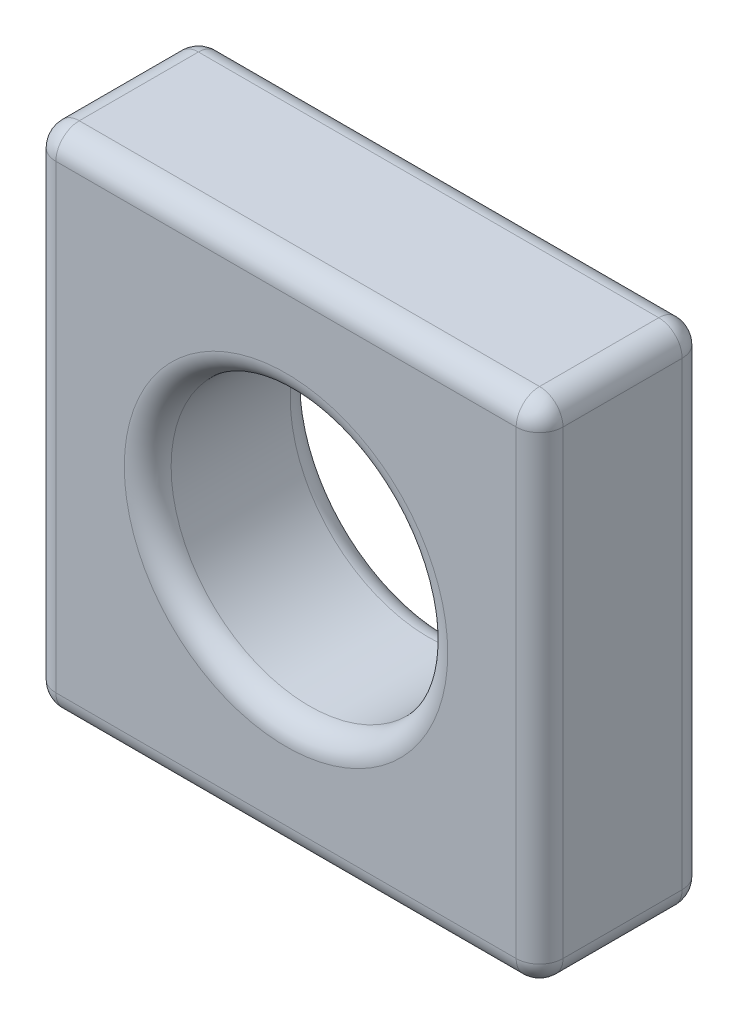
ISO-10303-21;
HEADER;
FILE_DESCRIPTION(('STEP AP214'),'2;1');
FILE_NAME('part.step','',(''),(''),'','','');
FILE_SCHEMA(('AUTOMOTIVE_DESIGN { 1 0 10303 214 1 1 1 1 }'));
ENDSEC;
DATA;
#1=APPLICATION_CONTEXT('core data for automotive mechanical design processes');
#2=APPLICATION_PROTOCOL_DEFINITION('international standard','automotive_design',2000,#1);
#3=PRODUCT_CONTEXT('',#1,'mechanical');
#4=PRODUCT('Part','Part','',(#3));
#5=PRODUCT_RELATED_PRODUCT_CATEGORY('part','',(#4));
#6=PRODUCT_DEFINITION_FORMATION('','',#4);
#7=PRODUCT_DEFINITION_CONTEXT('part definition',#1,'design');
#8=PRODUCT_DEFINITION('design','',#6,#7);
#9=PRODUCT_DEFINITION_SHAPE('','',#8);
#10=(LENGTH_UNIT() NAMED_UNIT(*) SI_UNIT(.MILLI.,.METRE.));
#11=(NAMED_UNIT(*) PLANE_ANGLE_UNIT() SI_UNIT($,.RADIAN.));
#12=(NAMED_UNIT(*) SI_UNIT($,.STERADIAN.) SOLID_ANGLE_UNIT());
#13=UNCERTAINTY_MEASURE_WITH_UNIT(LENGTH_MEASURE(1.E-05),#10,'distance_accuracy_value','');
#14=(GEOMETRIC_REPRESENTATION_CONTEXT(3) GLOBAL_UNCERTAINTY_ASSIGNED_CONTEXT((#13)) GLOBAL_UNIT_ASSIGNED_CONTEXT((#10,
#11,#12)) REPRESENTATION_CONTEXT('',''));
#15=CARTESIAN_POINT('',(0.,0.,0.));
#16=DIRECTION('',(0.,0.,1.));
#17=DIRECTION('',(1.,0.,0.));
#18=AXIS2_PLACEMENT_3D('',#15,#16,#17);
#19=CARTESIAN_POINT('',(0.,0.,1.8));
#20=DIRECTION('',(0.,0.,-1.));
#21=DIRECTION('',(-1.,0.,0.));
#22=AXIS2_PLACEMENT_3D('',#19,#20,#21);
#23=PLANE('',#22);
#24=DIRECTION('',(0.,1.,0.));
#25=VECTOR('',#24,1.);
#26=CARTESIAN_POINT('',(5.246,0.,1.8));
#27=LINE('',#26,#25);
#28=CARTESIAN_POINT('',(5.246,0.254,1.8));
#29=VERTEX_POINT('',#28);
#30=CARTESIAN_POINT('',(5.246,5.246,1.8));
#31=VERTEX_POINT('',#30);
#32=EDGE_CURVE('E157',#29,#31,#27,.T.);
#33=ORIENTED_EDGE('',*,*,#32,.T.);
#34=DIRECTION('',(-1.,0.,0.));
#35=VECTOR('',#34,1.);
#36=CARTESIAN_POINT('',(0.,5.246,1.8));
#37=LINE('',#36,#35);
#38=CARTESIAN_POINT('',(0.254,5.246,1.8));
#39=VERTEX_POINT('',#38);
#40=EDGE_CURVE('E128',#31,#39,#37,.T.);
#41=ORIENTED_EDGE('',*,*,#40,.T.);
#42=DIRECTION('',(0.,-1.,0.));
#43=VECTOR('',#42,1.);
#44=CARTESIAN_POINT('',(0.254,0.,1.8));
#45=LINE('',#44,#43);
#46=CARTESIAN_POINT('',(0.254,0.254,1.8));
#47=VERTEX_POINT('',#46);
#48=EDGE_CURVE('E146',#39,#47,#45,.T.);
#49=ORIENTED_EDGE('',*,*,#48,.T.);
#50=DIRECTION('',(1.,0.,0.));
#51=VECTOR('',#50,1.);
#52=CARTESIAN_POINT('',(0.,0.254,1.8));
#53=LINE('',#52,#51);
#54=EDGE_CURVE('E152',#47,#29,#53,.T.);
#55=ORIENTED_EDGE('',*,*,#54,.T.);
#56=EDGE_LOOP('',(#33,#41,#49,#55));
#57=FACE_BOUND('',#56,.T.);
#58=CARTESIAN_POINT('',(2.75,2.75,1.8));
#59=DIRECTION('',(0.,0.,-1.));
#60=DIRECTION('',(-1.,0.,0.));
#61=AXIS2_PLACEMENT_3D('',#58,#59,#60);
#62=CIRCLE('',#61,1.754);
#63=CARTESIAN_POINT('',(0.995999999999999,2.75,1.8));
#64=VERTEX_POINT('',#63);
#65=EDGE_CURVE('E153',#64,#64,#62,.T.);
#66=ORIENTED_EDGE('',*,*,#65,.T.);
#67=EDGE_LOOP('',(#66));
#68=FACE_BOUND('',#67,.T.);
#69=ADVANCED_FACE('F33',(#57,#68),#23,.F.);
#70=CARTESIAN_POINT('',(0.,0.,0.));
#71=DIRECTION('',(0.,0.,-1.));
#72=DIRECTION('',(-1.,0.,0.));
#73=AXIS2_PLACEMENT_3D('',#70,#71,#72);
#74=PLANE('',#73);
#75=DIRECTION('',(0.,1.,0.));
#76=VECTOR('',#75,1.);
#77=CARTESIAN_POINT('',(5.246,0.,0.));
#78=LINE('',#77,#76);
#79=CARTESIAN_POINT('',(5.246,5.246,0.));
#80=VERTEX_POINT('',#79);
#81=CARTESIAN_POINT('',(5.246,0.254,0.));
#82=VERTEX_POINT('',#81);
#83=EDGE_CURVE('E50',#80,#82,#78,.F.);
#84=ORIENTED_EDGE('',*,*,#83,.T.);
#85=DIRECTION('',(1.,0.,0.));
#86=VECTOR('',#85,1.);
#87=CARTESIAN_POINT('',(0.,0.254,0.));
#88=LINE('',#87,#86);
#89=CARTESIAN_POINT('',(0.254,0.254,0.));
#90=VERTEX_POINT('',#89);
#91=EDGE_CURVE('E204',#82,#90,#88,.F.);
#92=ORIENTED_EDGE('',*,*,#91,.T.);
#93=DIRECTION('',(0.,-1.,0.));
#94=VECTOR('',#93,1.);
#95=CARTESIAN_POINT('',(0.254,5.5,0.));
#96=LINE('',#95,#94);
#97=CARTESIAN_POINT('',(0.254,5.246,0.));
#98=VERTEX_POINT('',#97);
#99=EDGE_CURVE('E200',#90,#98,#96,.F.);
#100=ORIENTED_EDGE('',*,*,#99,.T.);
#101=DIRECTION('',(-1.,0.,0.));
#102=VECTOR('',#101,1.);
#103=CARTESIAN_POINT('',(5.5,5.246,0.));
#104=LINE('',#103,#102);
#105=EDGE_CURVE('E55',#98,#80,#104,.F.);
#106=ORIENTED_EDGE('',*,*,#105,.T.);
#107=EDGE_LOOP('',(#84,#92,#100,#106));
#108=FACE_BOUND('',#107,.T.);
#109=CARTESIAN_POINT('',(2.75,2.75,0.));
#110=DIRECTION('',(0.,0.,-1.));
#111=DIRECTION('',(-1.,0.,0.));
#112=AXIS2_PLACEMENT_3D('',#109,#110,#111);
#113=CIRCLE('',#112,1.754);
#114=CARTESIAN_POINT('',(0.995999999999999,2.75,0.));
#115=VERTEX_POINT('',#114);
#116=EDGE_CURVE('E197',#115,#115,#113,.F.);
#117=ORIENTED_EDGE('',*,*,#116,.T.);
#118=EDGE_LOOP('',(#117));
#119=FACE_BOUND('',#118,.T.);
#120=ADVANCED_FACE('F324',(#108,#119),#74,.T.);
#121=CARTESIAN_POINT('',(0.,0.,1.8));
#122=DIRECTION('',(1.,0.,0.));
#123=DIRECTION('',(0.,0.,-1.));
#124=AXIS2_PLACEMENT_3D('',#121,#122,#123);
#125=PLANE('',#124);
#126=DIRECTION('',(0.,-1.,0.));
#127=VECTOR('',#126,1.);
#128=CARTESIAN_POINT('',(0.,0.,0.254));
#129=LINE('',#128,#127);
#130=CARTESIAN_POINT('',(0.,5.246,0.254));
#131=VERTEX_POINT('',#130);
#132=CARTESIAN_POINT('',(0.,0.254,0.254));
#133=VERTEX_POINT('',#132);
#134=EDGE_CURVE('E190',#131,#133,#129,.T.);
#135=ORIENTED_EDGE('',*,*,#134,.T.);
#136=DIRECTION('',(0.,0.,-1.));
#137=VECTOR('',#136,1.);
#138=CARTESIAN_POINT('',(0.,0.254,1.8));
#139=LINE('',#138,#137);
#140=CARTESIAN_POINT('',(0.,0.254,1.546));
#141=VERTEX_POINT('',#140);
#142=EDGE_CURVE('E195',#133,#141,#139,.F.);
#143=ORIENTED_EDGE('',*,*,#142,.T.);
#144=DIRECTION('',(0.,-1.,0.));
#145=VECTOR('',#144,1.);
#146=CARTESIAN_POINT('',(0.,0.,1.546));
#147=LINE('',#146,#145);
#148=CARTESIAN_POINT('',(0.,5.246,1.546));
#149=VERTEX_POINT('',#148);
#150=EDGE_CURVE('E192',#141,#149,#147,.F.);
#151=ORIENTED_EDGE('',*,*,#150,.T.);
#152=DIRECTION('',(0.,0.,-1.));
#153=VECTOR('',#152,1.);
#154=CARTESIAN_POINT('',(0.,5.246,1.8));
#155=LINE('',#154,#153);
#156=EDGE_CURVE('E188',#149,#131,#155,.T.);
#157=ORIENTED_EDGE('',*,*,#156,.T.);
#158=EDGE_LOOP('',(#135,#143,#151,#157));
#159=FACE_BOUND('',#158,.T.);
#160=ADVANCED_FACE('F304',(#159),#125,.F.);
#161=CARTESIAN_POINT('',(0.,0.,1.8));
#162=DIRECTION('',(0.,1.,0.));
#163=DIRECTION('',(0.,0.,1.));
#164=AXIS2_PLACEMENT_3D('',#161,#162,#163);
#165=PLANE('',#164);
#166=DIRECTION('',(1.,0.,0.));
#167=VECTOR('',#166,1.);
#168=CARTESIAN_POINT('',(5.5,0.,0.254));
#169=LINE('',#168,#167);
#170=CARTESIAN_POINT('',(0.254,0.,0.254));
#171=VERTEX_POINT('',#170);
#172=CARTESIAN_POINT('',(5.246,0.,0.254));
#173=VERTEX_POINT('',#172);
#174=EDGE_CURVE('E181',#171,#173,#169,.T.);
#175=ORIENTED_EDGE('',*,*,#174,.T.);
#176=DIRECTION('',(0.,0.,-1.));
#177=VECTOR('',#176,1.);
#178=CARTESIAN_POINT('',(5.246,0.,1.8));
#179=LINE('',#178,#177);
#180=CARTESIAN_POINT('',(5.246,0.,1.546));
#181=VERTEX_POINT('',#180);
#182=EDGE_CURVE('E186',#173,#181,#179,.F.);
#183=ORIENTED_EDGE('',*,*,#182,.T.);
#184=DIRECTION('',(1.,0.,0.));
#185=VECTOR('',#184,1.);
#186=CARTESIAN_POINT('',(0.,0.,1.546));
#187=LINE('',#186,#185);
#188=CARTESIAN_POINT('',(0.254,0.,1.546));
#189=VERTEX_POINT('',#188);
#190=EDGE_CURVE('E183',#181,#189,#187,.F.);
#191=ORIENTED_EDGE('',*,*,#190,.T.);
#192=DIRECTION('',(0.,0.,-1.));
#193=VECTOR('',#192,1.);
#194=CARTESIAN_POINT('',(0.254,0.,1.8));
#195=LINE('',#194,#193);
#196=EDGE_CURVE('E179',#189,#171,#195,.T.);
#197=ORIENTED_EDGE('',*,*,#196,.T.);
#198=EDGE_LOOP('',(#175,#183,#191,#197));
#199=FACE_BOUND('',#198,.T.);
#200=ADVANCED_FACE('F338',(#199),#165,.F.);
#201=CARTESIAN_POINT('',(5.5,0.,1.8));
#202=DIRECTION('',(-1.,0.,0.));
#203=DIRECTION('',(0.,0.,1.));
#204=AXIS2_PLACEMENT_3D('',#201,#202,#203);
#205=PLANE('',#204);
#206=DIRECTION('',(0.,1.,0.));
#207=VECTOR('',#206,1.);
#208=CARTESIAN_POINT('',(5.5,0.,1.546));
#209=LINE('',#208,#207);
#210=CARTESIAN_POINT('',(5.5,5.246,1.546));
#211=VERTEX_POINT('',#210);
#212=CARTESIAN_POINT('',(5.5,0.254,1.546));
#213=VERTEX_POINT('',#212);
#214=EDGE_CURVE('E174',#211,#213,#209,.F.);
#215=ORIENTED_EDGE('',*,*,#214,.T.);
#216=DIRECTION('',(0.,0.,-1.));
#217=VECTOR('',#216,1.);
#218=CARTESIAN_POINT('',(5.5,0.254,1.8));
#219=LINE('',#218,#217);
#220=CARTESIAN_POINT('',(5.5,0.254,0.254));
#221=VERTEX_POINT('',#220);
#222=EDGE_CURVE('E177',#213,#221,#219,.T.);
#223=ORIENTED_EDGE('',*,*,#222,.T.);
#224=DIRECTION('',(0.,1.,0.));
#225=VECTOR('',#224,1.);
#226=CARTESIAN_POINT('',(5.5,5.5,0.254));
#227=LINE('',#226,#225);
#228=CARTESIAN_POINT('',(5.5,5.246,0.254));
#229=VERTEX_POINT('',#228);
#230=EDGE_CURVE('E172',#221,#229,#227,.T.);
#231=ORIENTED_EDGE('',*,*,#230,.T.);
#232=DIRECTION('',(0.,0.,-1.));
#233=VECTOR('',#232,1.);
#234=CARTESIAN_POINT('',(5.5,5.246,1.8));
#235=LINE('',#234,#233);
#236=EDGE_CURVE('E170',#229,#211,#235,.F.);
#237=ORIENTED_EDGE('',*,*,#236,.T.);
#238=EDGE_LOOP('',(#215,#223,#231,#237));
#239=FACE_BOUND('',#238,.T.);
#240=ADVANCED_FACE('F335',(#239),#205,.F.);
#241=CARTESIAN_POINT('',(0.,5.5,1.8));
#242=DIRECTION('',(0.,-1.,0.));
#243=DIRECTION('',(0.,0.,-1.));
#244=AXIS2_PLACEMENT_3D('',#241,#242,#243);
#245=PLANE('',#244);
#246=DIRECTION('',(-1.,0.,0.));
#247=VECTOR('',#246,1.);
#248=CARTESIAN_POINT('',(0.,5.5,0.254));
#249=LINE('',#248,#247);
#250=CARTESIAN_POINT('',(5.246,5.5,0.254));
#251=VERTEX_POINT('',#250);
#252=CARTESIAN_POINT('',(0.254,5.5,0.254));
#253=VERTEX_POINT('',#252);
#254=EDGE_CURVE('E161',#251,#253,#249,.T.);
#255=ORIENTED_EDGE('',*,*,#254,.T.);
#256=DIRECTION('',(0.,0.,-1.));
#257=VECTOR('',#256,1.);
#258=CARTESIAN_POINT('',(0.254,5.5,1.8));
#259=LINE('',#258,#257);
#260=CARTESIAN_POINT('',(0.254,5.5,1.546));
#261=VERTEX_POINT('',#260);
#262=EDGE_CURVE('E168',#253,#261,#259,.F.);
#263=ORIENTED_EDGE('',*,*,#262,.T.);
#264=DIRECTION('',(-1.,0.,0.));
#265=VECTOR('',#264,1.);
#266=CARTESIAN_POINT('',(0.,5.5,1.546));
#267=LINE('',#266,#265);
#268=CARTESIAN_POINT('',(5.246,5.5,1.546));
#269=VERTEX_POINT('',#268);
#270=EDGE_CURVE('E130',#261,#269,#267,.F.);
#271=ORIENTED_EDGE('',*,*,#270,.T.);
#272=DIRECTION('',(0.,0.,-1.));
#273=VECTOR('',#272,1.);
#274=CARTESIAN_POINT('',(5.246,5.5,1.8));
#275=LINE('',#274,#273);
#276=EDGE_CURVE('E159',#269,#251,#275,.T.);
#277=ORIENTED_EDGE('',*,*,#276,.T.);
#278=EDGE_LOOP('',(#255,#263,#271,#277));
#279=FACE_BOUND('',#278,.T.);
#280=ADVANCED_FACE('F296',(#279),#245,.F.);
#281=CARTESIAN_POINT('',(2.75,2.75,1.8));
#282=DIRECTION('',(0.,0.,-1.));
#283=DIRECTION('',(-1.,0.,0.));
#284=AXIS2_PLACEMENT_3D('',#281,#282,#283);
#285=CYLINDRICAL_SURFACE('',#284,1.5);
#286=CARTESIAN_POINT('',(2.75,2.75,0.254));
#287=DIRECTION('',(0.,0.,-1.));
#288=DIRECTION('',(-1.,0.,0.));
#289=AXIS2_PLACEMENT_3D('',#286,#287,#288);
#290=CIRCLE('',#289,1.5);
#291=CARTESIAN_POINT('',(1.25,2.75,0.254));
#292=VERTEX_POINT('',#291);
#293=EDGE_CURVE('E11',#292,#292,#290,.T.);
#294=ORIENTED_EDGE('',*,*,#293,.T.);
#295=EDGE_LOOP('',(#294));
#296=FACE_BOUND('',#295,.T.);
#297=CARTESIAN_POINT('',(2.75,2.75,1.546));
#298=DIRECTION('',(0.,0.,-1.));
#299=DIRECTION('',(-1.,0.,0.));
#300=AXIS2_PLACEMENT_3D('',#297,#298,#299);
#301=CIRCLE('',#300,1.5);
#302=CARTESIAN_POINT('',(1.25,2.75,1.546));
#303=VERTEX_POINT('',#302);
#304=EDGE_CURVE('E42',#303,#303,#301,.F.);
#305=ORIENTED_EDGE('',*,*,#304,.T.);
#306=EDGE_LOOP('',(#305));
#307=FACE_BOUND('',#306,.T.);
#308=ADVANCED_FACE('F331',(#296,#307),#285,.F.);
#309=CARTESIAN_POINT('',(0.,0.254,0.254));
#310=DIRECTION('',(-1.,0.,0.));
#311=DIRECTION('',(0.,0.,1.));
#312=AXIS2_PLACEMENT_3D('',#309,#310,#311);
#313=CYLINDRICAL_SURFACE('',#312,0.254);
#314=CARTESIAN_POINT('',(5.246,0.254,0.254));
#315=DIRECTION('',(1.,0.,0.));
#316=DIRECTION('',(0.,0.,-1.));
#317=AXIS2_PLACEMENT_3D('',#314,#315,#316);
#318=CIRCLE('',#317,0.254);
#319=EDGE_CURVE('E37',#173,#82,#318,.T.);
#320=ORIENTED_EDGE('',*,*,#319,.F.);
#321=ORIENTED_EDGE('',*,*,#174,.F.);
#322=CARTESIAN_POINT('',(0.254,0.254,0.254));
#323=DIRECTION('',(-1.,0.,0.));
#324=DIRECTION('',(0.,0.,1.));
#325=AXIS2_PLACEMENT_3D('',#322,#323,#324);
#326=CIRCLE('',#325,0.254);
#327=EDGE_CURVE('E258',#90,#171,#326,.T.);
#328=ORIENTED_EDGE('',*,*,#327,.F.);
#329=ORIENTED_EDGE('',*,*,#91,.F.);
#330=EDGE_LOOP('',(#320,#321,#328,#329));
#331=FACE_BOUND('',#330,.T.);
#332=ADVANCED_FACE('F505',(#331),#313,.T.);
#333=CARTESIAN_POINT('',(5.246,0.254,0.254));
#334=DIRECTION('',(0.,0.,1.));
#335=DIRECTION('',(1.,0.,0.));
#336=AXIS2_PLACEMENT_3D('',#333,#334,#335);
#337=SPHERICAL_SURFACE('',#336,0.254);
#338=CARTESIAN_POINT('',(5.246,0.254,0.254));
#339=DIRECTION('',(0.,0.,-1.));
#340=DIRECTION('',(-1.,0.,0.));
#341=AXIS2_PLACEMENT_3D('',#338,#339,#340);
#342=CIRCLE('',#341,0.254);
#343=EDGE_CURVE('E253',#173,#221,#342,.F.);
#344=ORIENTED_EDGE('',*,*,#343,.F.);
#345=ORIENTED_EDGE('',*,*,#319,.T.);
#346=CARTESIAN_POINT('',(5.246,0.254,0.254));
#347=DIRECTION('',(0.,-1.,0.));
#348=DIRECTION('',(0.,0.,-1.));
#349=AXIS2_PLACEMENT_3D('',#346,#347,#348);
#350=CIRCLE('',#349,0.254);
#351=EDGE_CURVE('E256',#221,#82,#350,.F.);
#352=ORIENTED_EDGE('',*,*,#351,.F.);
#353=EDGE_LOOP('',(#344,#345,#352));
#354=FACE_BOUND('',#353,.T.);
#355=ADVANCED_FACE('F497',(#354),#337,.T.);
#356=CARTESIAN_POINT('',(0.254,0.254,0.254));
#357=DIRECTION('',(0.,0.,1.));
#358=DIRECTION('',(1.,0.,0.));
#359=AXIS2_PLACEMENT_3D('',#356,#357,#358);
#360=SPHERICAL_SURFACE('',#359,0.254);
#361=CARTESIAN_POINT('',(0.254,0.254,0.254));
#362=DIRECTION('',(0.,-1.,0.));
#363=DIRECTION('',(0.,0.,-1.));
#364=AXIS2_PLACEMENT_3D('',#361,#362,#363);
#365=CIRCLE('',#364,0.254);
#366=EDGE_CURVE('E247',#90,#133,#365,.F.);
#367=ORIENTED_EDGE('',*,*,#366,.F.);
#368=ORIENTED_EDGE('',*,*,#327,.T.);
#369=CARTESIAN_POINT('',(0.254,0.254,0.254));
#370=DIRECTION('',(0.,0.,-1.));
#371=DIRECTION('',(-1.,0.,0.));
#372=AXIS2_PLACEMENT_3D('',#369,#370,#371);
#373=CIRCLE('',#372,0.254);
#374=EDGE_CURVE('E250',#133,#171,#373,.F.);
#375=ORIENTED_EDGE('',*,*,#374,.F.);
#376=EDGE_LOOP('',(#367,#368,#375));
#377=FACE_BOUND('',#376,.T.);
#378=ADVANCED_FACE('F488',(#377),#360,.T.);
#379=CARTESIAN_POINT('',(5.246,0.,0.254));
#380=DIRECTION('',(0.,-1.,0.));
#381=DIRECTION('',(0.,0.,-1.));
#382=AXIS2_PLACEMENT_3D('',#379,#380,#381);
#383=CYLINDRICAL_SURFACE('',#382,0.254);
#384=ORIENTED_EDGE('',*,*,#351,.T.);
#385=ORIENTED_EDGE('',*,*,#83,.F.);
#386=CARTESIAN_POINT('',(5.246,5.246,0.254));
#387=DIRECTION('',(0.,1.,0.));
#388=DIRECTION('',(0.,0.,1.));
#389=AXIS2_PLACEMENT_3D('',#386,#387,#388);
#390=CIRCLE('',#389,0.254);
#391=EDGE_CURVE('E241',#229,#80,#390,.T.);
#392=ORIENTED_EDGE('',*,*,#391,.F.);
#393=ORIENTED_EDGE('',*,*,#230,.F.);
#394=EDGE_LOOP('',(#384,#385,#392,#393));
#395=FACE_BOUND('',#394,.T.);
#396=ADVANCED_FACE('F479',(#395),#383,.T.);
#397=CARTESIAN_POINT('',(5.246,0.254,1.8));
#398=DIRECTION('',(0.,0.,-1.));
#399=DIRECTION('',(-1.,0.,0.));
#400=AXIS2_PLACEMENT_3D('',#397,#398,#399);
#401=CYLINDRICAL_SURFACE('',#400,0.254);
#402=ORIENTED_EDGE('',*,*,#343,.T.);
#403=ORIENTED_EDGE('',*,*,#222,.F.);
#404=CARTESIAN_POINT('',(5.246,0.254,1.546));
#405=DIRECTION('',(0.,0.,1.));
#406=DIRECTION('',(1.,0.,0.));
#407=AXIS2_PLACEMENT_3D('',#404,#405,#406);
#408=CIRCLE('',#407,0.254);
#409=EDGE_CURVE('E238',#181,#213,#408,.T.);
#410=ORIENTED_EDGE('',*,*,#409,.F.);
#411=ORIENTED_EDGE('',*,*,#182,.F.);
#412=EDGE_LOOP('',(#402,#403,#410,#411));
#413=FACE_BOUND('',#412,.T.);
#414=ADVANCED_FACE('F471',(#413),#401,.T.);
#415=CARTESIAN_POINT('',(0.,0.254,1.546));
#416=DIRECTION('',(1.,0.,0.));
#417=DIRECTION('',(0.,0.,-1.));
#418=AXIS2_PLACEMENT_3D('',#415,#416,#417);
#419=CYLINDRICAL_SURFACE('',#418,0.254);
#420=CARTESIAN_POINT('',(0.254,0.254,1.546));
#421=DIRECTION('',(-1.,0.,0.));
#422=DIRECTION('',(0.,0.,1.));
#423=AXIS2_PLACEMENT_3D('',#420,#421,#422);
#424=CIRCLE('',#423,0.254);
#425=EDGE_CURVE('E232',#189,#47,#424,.T.);
#426=ORIENTED_EDGE('',*,*,#425,.F.);
#427=ORIENTED_EDGE('',*,*,#190,.F.);
#428=CARTESIAN_POINT('',(5.246,0.254,1.546));
#429=DIRECTION('',(1.,0.,0.));
#430=DIRECTION('',(0.,0.,-1.));
#431=AXIS2_PLACEMENT_3D('',#428,#429,#430);
#432=CIRCLE('',#431,0.254);
#433=EDGE_CURVE('E235',#29,#181,#432,.T.);
#434=ORIENTED_EDGE('',*,*,#433,.F.);
#435=ORIENTED_EDGE('',*,*,#54,.F.);
#436=EDGE_LOOP('',(#426,#427,#434,#435));
#437=FACE_BOUND('',#436,.T.);
#438=ADVANCED_FACE('F277',(#437),#419,.T.);
#439=CARTESIAN_POINT('',(0.254,0.254,1.8));
#440=DIRECTION('',(0.,0.,-1.));
#441=DIRECTION('',(-1.,0.,0.));
#442=AXIS2_PLACEMENT_3D('',#439,#440,#441);
#443=CYLINDRICAL_SURFACE('',#442,0.254);
#444=ORIENTED_EDGE('',*,*,#374,.T.);
#445=ORIENTED_EDGE('',*,*,#196,.F.);
#446=CARTESIAN_POINT('',(0.254,0.254,1.546));
#447=DIRECTION('',(0.,0.,1.));
#448=DIRECTION('',(1.,0.,0.));
#449=AXIS2_PLACEMENT_3D('',#446,#447,#448);
#450=CIRCLE('',#449,0.254);
#451=EDGE_CURVE('E230',#141,#189,#450,.T.);
#452=ORIENTED_EDGE('',*,*,#451,.F.);
#453=ORIENTED_EDGE('',*,*,#142,.F.);
#454=EDGE_LOOP('',(#444,#445,#452,#453));
#455=FACE_BOUND('',#454,.T.);
#456=ADVANCED_FACE('F309',(#455),#443,.T.);
#457=CARTESIAN_POINT('',(0.254,0.,0.254));
#458=DIRECTION('',(0.,1.,0.));
#459=DIRECTION('',(0.,0.,1.));
#460=AXIS2_PLACEMENT_3D('',#457,#458,#459);
#461=CYLINDRICAL_SURFACE('',#460,0.254);
#462=ORIENTED_EDGE('',*,*,#366,.T.);
#463=ORIENTED_EDGE('',*,*,#134,.F.);
#464=CARTESIAN_POINT('',(0.254,5.246,0.254));
#465=DIRECTION('',(0.,1.,0.));
#466=DIRECTION('',(0.,0.,1.));
#467=AXIS2_PLACEMENT_3D('',#464,#465,#466);
#468=CIRCLE('',#467,0.254);
#469=EDGE_CURVE('E227',#98,#131,#468,.T.);
#470=ORIENTED_EDGE('',*,*,#469,.F.);
#471=ORIENTED_EDGE('',*,*,#99,.F.);
#472=EDGE_LOOP('',(#462,#463,#470,#471));
#473=FACE_BOUND('',#472,.T.);
#474=ADVANCED_FACE('F447',(#473),#461,.T.);
#475=CARTESIAN_POINT('',(0.,5.246,0.254));
#476=DIRECTION('',(1.,0.,0.));
#477=DIRECTION('',(0.,0.,-1.));
#478=AXIS2_PLACEMENT_3D('',#475,#476,#477);
#479=CYLINDRICAL_SURFACE('',#478,0.254);
#480=CARTESIAN_POINT('',(5.246,5.246,0.254));
#481=DIRECTION('',(1.,0.,0.));
#482=DIRECTION('',(0.,0.,-1.));
#483=AXIS2_PLACEMENT_3D('',#480,#481,#482);
#484=CIRCLE('',#483,0.254);
#485=EDGE_CURVE('E244',#80,#251,#484,.T.);
#486=ORIENTED_EDGE('',*,*,#485,.F.);
#487=ORIENTED_EDGE('',*,*,#105,.F.);
#488=CARTESIAN_POINT('',(0.254,5.246,0.254));
#489=DIRECTION('',(-1.,0.,0.));
#490=DIRECTION('',(0.,0.,1.));
#491=AXIS2_PLACEMENT_3D('',#488,#489,#490);
#492=CIRCLE('',#491,0.254);
#493=EDGE_CURVE('E224',#253,#98,#492,.T.);
#494=ORIENTED_EDGE('',*,*,#493,.F.);
#495=ORIENTED_EDGE('',*,*,#254,.F.);
#496=EDGE_LOOP('',(#486,#487,#494,#495));
#497=FACE_BOUND('',#496,.T.);
#498=ADVANCED_FACE('F438',(#497),#479,.T.);
#499=CARTESIAN_POINT('',(5.246,5.246,0.254));
#500=DIRECTION('',(0.,0.,1.));
#501=DIRECTION('',(1.,0.,0.));
#502=AXIS2_PLACEMENT_3D('',#499,#500,#501);
#503=SPHERICAL_SURFACE('',#502,0.254);
#504=ORIENTED_EDGE('',*,*,#391,.T.);
#505=ORIENTED_EDGE('',*,*,#485,.T.);
#506=CARTESIAN_POINT('',(5.246,5.246,0.254));
#507=DIRECTION('',(0.,0.,-1.));
#508=DIRECTION('',(-1.,0.,0.));
#509=AXIS2_PLACEMENT_3D('',#506,#507,#508);
#510=CIRCLE('',#509,0.254);
#511=EDGE_CURVE('E221',#229,#251,#510,.F.);
#512=ORIENTED_EDGE('',*,*,#511,.F.);
#513=EDGE_LOOP('',(#504,#505,#512));
#514=FACE_BOUND('',#513,.T.);
#515=ADVANCED_FACE('F321',(#514),#503,.T.);
#516=CARTESIAN_POINT('',(5.246,0.254,1.546));
#517=DIRECTION('',(0.,0.,1.));
#518=DIRECTION('',(1.,0.,0.));
#519=AXIS2_PLACEMENT_3D('',#516,#517,#518);
#520=SPHERICAL_SURFACE('',#519,0.254);
#521=ORIENTED_EDGE('',*,*,#433,.T.);
#522=ORIENTED_EDGE('',*,*,#409,.T.);
#523=CARTESIAN_POINT('',(5.246,0.254,1.546));
#524=DIRECTION('',(0.,-1.,0.));
#525=DIRECTION('',(0.,0.,-1.));
#526=AXIS2_PLACEMENT_3D('',#523,#524,#525);
#527=CIRCLE('',#526,0.254);
#528=EDGE_CURVE('E219',#29,#213,#527,.F.);
#529=ORIENTED_EDGE('',*,*,#528,.F.);
#530=EDGE_LOOP('',(#521,#522,#529));
#531=FACE_BOUND('',#530,.T.);
#532=ADVANCED_FACE('F280',(#531),#520,.T.);
#533=CARTESIAN_POINT('',(0.254,0.254,1.546));
#534=DIRECTION('',(0.,0.,1.));
#535=DIRECTION('',(1.,0.,0.));
#536=AXIS2_PLACEMENT_3D('',#533,#534,#535);
#537=SPHERICAL_SURFACE('',#536,0.254);
#538=ORIENTED_EDGE('',*,*,#451,.T.);
#539=ORIENTED_EDGE('',*,*,#425,.T.);
#540=CARTESIAN_POINT('',(0.254,0.254,1.546));
#541=DIRECTION('',(0.,-1.,0.));
#542=DIRECTION('',(0.,0.,-1.));
#543=AXIS2_PLACEMENT_3D('',#540,#541,#542);
#544=CIRCLE('',#543,0.254);
#545=EDGE_CURVE('E149',#141,#47,#544,.F.);
#546=ORIENTED_EDGE('',*,*,#545,.F.);
#547=EDGE_LOOP('',(#538,#539,#546));
#548=FACE_BOUND('',#547,.T.);
#549=ADVANCED_FACE('F311',(#548),#537,.T.);
#550=CARTESIAN_POINT('',(0.254,5.246,0.254));
#551=DIRECTION('',(0.,0.,1.));
#552=DIRECTION('',(1.,0.,0.));
#553=AXIS2_PLACEMENT_3D('',#550,#551,#552);
#554=SPHERICAL_SURFACE('',#553,0.254);
#555=ORIENTED_EDGE('',*,*,#493,.T.);
#556=ORIENTED_EDGE('',*,*,#469,.T.);
#557=CARTESIAN_POINT('',(0.254,5.246,0.254));
#558=DIRECTION('',(0.,0.,-1.));
#559=DIRECTION('',(-1.,0.,0.));
#560=AXIS2_PLACEMENT_3D('',#557,#558,#559);
#561=CIRCLE('',#560,0.254);
#562=EDGE_CURVE('E215',#253,#131,#561,.F.);
#563=ORIENTED_EDGE('',*,*,#562,.F.);
#564=EDGE_LOOP('',(#555,#556,#563));
#565=FACE_BOUND('',#564,.T.);
#566=ADVANCED_FACE('F313',(#565),#554,.T.);
#567=CARTESIAN_POINT('',(5.246,5.246,1.8));
#568=DIRECTION('',(0.,0.,-1.));
#569=DIRECTION('',(-1.,0.,0.));
#570=AXIS2_PLACEMENT_3D('',#567,#568,#569);
#571=CYLINDRICAL_SURFACE('',#570,0.254);
#572=ORIENTED_EDGE('',*,*,#511,.T.);
#573=ORIENTED_EDGE('',*,*,#276,.F.);
#574=CARTESIAN_POINT('',(5.246,5.246,1.546));
#575=DIRECTION('',(0.,0.,1.));
#576=DIRECTION('',(1.,0.,0.));
#577=AXIS2_PLACEMENT_3D('',#574,#575,#576);
#578=CIRCLE('',#577,0.254);
#579=EDGE_CURVE('E212',#211,#269,#578,.T.);
#580=ORIENTED_EDGE('',*,*,#579,.F.);
#581=ORIENTED_EDGE('',*,*,#236,.F.);
#582=EDGE_LOOP('',(#572,#573,#580,#581));
#583=FACE_BOUND('',#582,.T.);
#584=ADVANCED_FACE('F292',(#583),#571,.T.);
#585=CARTESIAN_POINT('',(5.246,0.,1.546));
#586=DIRECTION('',(0.,1.,0.));
#587=DIRECTION('',(0.,0.,1.));
#588=AXIS2_PLACEMENT_3D('',#585,#586,#587);
#589=CYLINDRICAL_SURFACE('',#588,0.254);
#590=ORIENTED_EDGE('',*,*,#528,.T.);
#591=ORIENTED_EDGE('',*,*,#214,.F.);
#592=CARTESIAN_POINT('',(5.246,5.246,1.546));
#593=DIRECTION('',(0.,1.,0.));
#594=DIRECTION('',(0.,0.,1.));
#595=AXIS2_PLACEMENT_3D('',#592,#593,#594);
#596=CIRCLE('',#595,0.254);
#597=EDGE_CURVE('E143',#31,#211,#596,.T.);
#598=ORIENTED_EDGE('',*,*,#597,.F.);
#599=ORIENTED_EDGE('',*,*,#32,.F.);
#600=EDGE_LOOP('',(#590,#591,#598,#599));
#601=FACE_BOUND('',#600,.T.);
#602=ADVANCED_FACE('F284',(#601),#589,.T.);
#603=CARTESIAN_POINT('',(0.254,0.,1.546));
#604=DIRECTION('',(0.,-1.,0.));
#605=DIRECTION('',(0.,0.,-1.));
#606=AXIS2_PLACEMENT_3D('',#603,#604,#605);
#607=CYLINDRICAL_SURFACE('',#606,0.254);
#608=ORIENTED_EDGE('',*,*,#545,.T.);
#609=ORIENTED_EDGE('',*,*,#48,.F.);
#610=CARTESIAN_POINT('',(0.254,5.246,1.546));
#611=DIRECTION('',(0.,1.,0.));
#612=DIRECTION('',(0.,0.,1.));
#613=AXIS2_PLACEMENT_3D('',#610,#611,#612);
#614=CIRCLE('',#613,0.254);
#615=EDGE_CURVE('E135',#149,#39,#614,.T.);
#616=ORIENTED_EDGE('',*,*,#615,.F.);
#617=ORIENTED_EDGE('',*,*,#150,.F.);
#618=EDGE_LOOP('',(#608,#609,#616,#617));
#619=FACE_BOUND('',#618,.T.);
#620=ADVANCED_FACE('F147',(#619),#607,.T.);
#621=CARTESIAN_POINT('',(0.254,5.246,1.8));
#622=DIRECTION('',(0.,0.,-1.));
#623=DIRECTION('',(-1.,0.,0.));
#624=AXIS2_PLACEMENT_3D('',#621,#622,#623);
#625=CYLINDRICAL_SURFACE('',#624,0.254);
#626=ORIENTED_EDGE('',*,*,#562,.T.);
#627=ORIENTED_EDGE('',*,*,#156,.F.);
#628=CARTESIAN_POINT('',(0.254,5.246,1.546));
#629=DIRECTION('',(0.,0.,1.));
#630=DIRECTION('',(1.,0.,0.));
#631=AXIS2_PLACEMENT_3D('',#628,#629,#630);
#632=CIRCLE('',#631,0.254);
#633=EDGE_CURVE('E139',#261,#149,#632,.T.);
#634=ORIENTED_EDGE('',*,*,#633,.F.);
#635=ORIENTED_EDGE('',*,*,#262,.F.);
#636=EDGE_LOOP('',(#626,#627,#634,#635));
#637=FACE_BOUND('',#636,.T.);
#638=ADVANCED_FACE('F300',(#637),#625,.T.);
#639=CARTESIAN_POINT('',(5.246,5.246,1.546));
#640=DIRECTION('',(0.,0.,1.));
#641=DIRECTION('',(1.,0.,0.));
#642=AXIS2_PLACEMENT_3D('',#639,#640,#641);
#643=SPHERICAL_SURFACE('',#642,0.254);
#644=ORIENTED_EDGE('',*,*,#597,.T.);
#645=ORIENTED_EDGE('',*,*,#579,.T.);
#646=CARTESIAN_POINT('',(5.246,5.246,1.546));
#647=DIRECTION('',(1.,0.,0.));
#648=DIRECTION('',(0.,0.,-1.));
#649=AXIS2_PLACEMENT_3D('',#646,#647,#648);
#650=CIRCLE('',#649,0.254);
#651=EDGE_CURVE('E132',#31,#269,#650,.F.);
#652=ORIENTED_EDGE('',*,*,#651,.F.);
#653=EDGE_LOOP('',(#644,#645,#652));
#654=FACE_BOUND('',#653,.T.);
#655=ADVANCED_FACE('F288',(#654),#643,.T.);
#656=CARTESIAN_POINT('',(0.254,5.246,1.546));
#657=DIRECTION('',(0.,0.,1.));
#658=DIRECTION('',(1.,0.,0.));
#659=AXIS2_PLACEMENT_3D('',#656,#657,#658);
#660=SPHERICAL_SURFACE('',#659,0.254);
#661=ORIENTED_EDGE('',*,*,#633,.T.);
#662=ORIENTED_EDGE('',*,*,#615,.T.);
#663=CARTESIAN_POINT('',(0.254,5.246,1.546));
#664=DIRECTION('',(-1.,0.,0.));
#665=DIRECTION('',(0.,0.,1.));
#666=AXIS2_PLACEMENT_3D('',#663,#664,#665);
#667=CIRCLE('',#666,0.254);
#668=EDGE_CURVE('E124',#261,#39,#667,.F.);
#669=ORIENTED_EDGE('',*,*,#668,.F.);
#670=EDGE_LOOP('',(#661,#662,#669));
#671=FACE_BOUND('',#670,.T.);
#672=ADVANCED_FACE('F137',(#671),#660,.T.);
#673=CARTESIAN_POINT('',(0.,5.246,1.546));
#674=DIRECTION('',(-1.,0.,0.));
#675=DIRECTION('',(0.,0.,1.));
#676=AXIS2_PLACEMENT_3D('',#673,#674,#675);
#677=CYLINDRICAL_SURFACE('',#676,0.254);
#678=ORIENTED_EDGE('',*,*,#651,.T.);
#679=ORIENTED_EDGE('',*,*,#270,.F.);
#680=ORIENTED_EDGE('',*,*,#668,.T.);
#681=ORIENTED_EDGE('',*,*,#40,.F.);
#682=EDGE_LOOP('',(#678,#679,#680,#681));
#683=FACE_BOUND('',#682,.T.);
#684=ADVANCED_FACE('F126',(#683),#677,.T.);
#685=CARTESIAN_POINT('',(2.75,2.75,0.254));
#686=DIRECTION('',(0.,0.,-1.));
#687=DIRECTION('',(-1.,0.,0.));
#688=AXIS2_PLACEMENT_3D('',#685,#686,#687);
#689=TOROIDAL_SURFACE('',#688,1.754,0.254);
#690=ORIENTED_EDGE('',*,*,#293,.F.);
#691=EDGE_LOOP('',(#690));
#692=FACE_BOUND('',#691,.T.);
#693=ORIENTED_EDGE('',*,*,#116,.F.);
#694=EDGE_LOOP('',(#693));
#695=FACE_BOUND('',#694,.T.);
#696=ADVANCED_FACE('F347',(#692,#695),#689,.T.);
#697=CARTESIAN_POINT('',(2.75,2.75,1.546));
#698=DIRECTION('',(0.,0.,-1.));
#699=DIRECTION('',(-1.,0.,0.));
#700=AXIS2_PLACEMENT_3D('',#697,#698,#699);
#701=TOROIDAL_SURFACE('',#700,1.754,0.254);
#702=ORIENTED_EDGE('',*,*,#65,.F.);
#703=EDGE_LOOP('',(#702));
#704=FACE_BOUND('',#703,.T.);
#705=ORIENTED_EDGE('',*,*,#304,.F.);
#706=EDGE_LOOP('',(#705));
#707=FACE_BOUND('',#706,.T.);
#708=ADVANCED_FACE('F35',(#704,#707),#701,.T.);
#709=CLOSED_SHELL('',(#69,#120,#160,#200,#240,#280,#308,#332,#355,#378,#396,#414,#438,#456,#474,
#498,#515,#532,#549,#566,#584,#602,#620,#638,#655,#672,#684,#696,#708));
#710=MANIFOLD_SOLID_BREP('B2',#709);
#711=ADVANCED_BREP_SHAPE_REPRESENTATION('',(#18,#710),#14);
#712=SHAPE_DEFINITION_REPRESENTATION(#9,#711);
ENDSEC;
END-ISO-10303-21;
